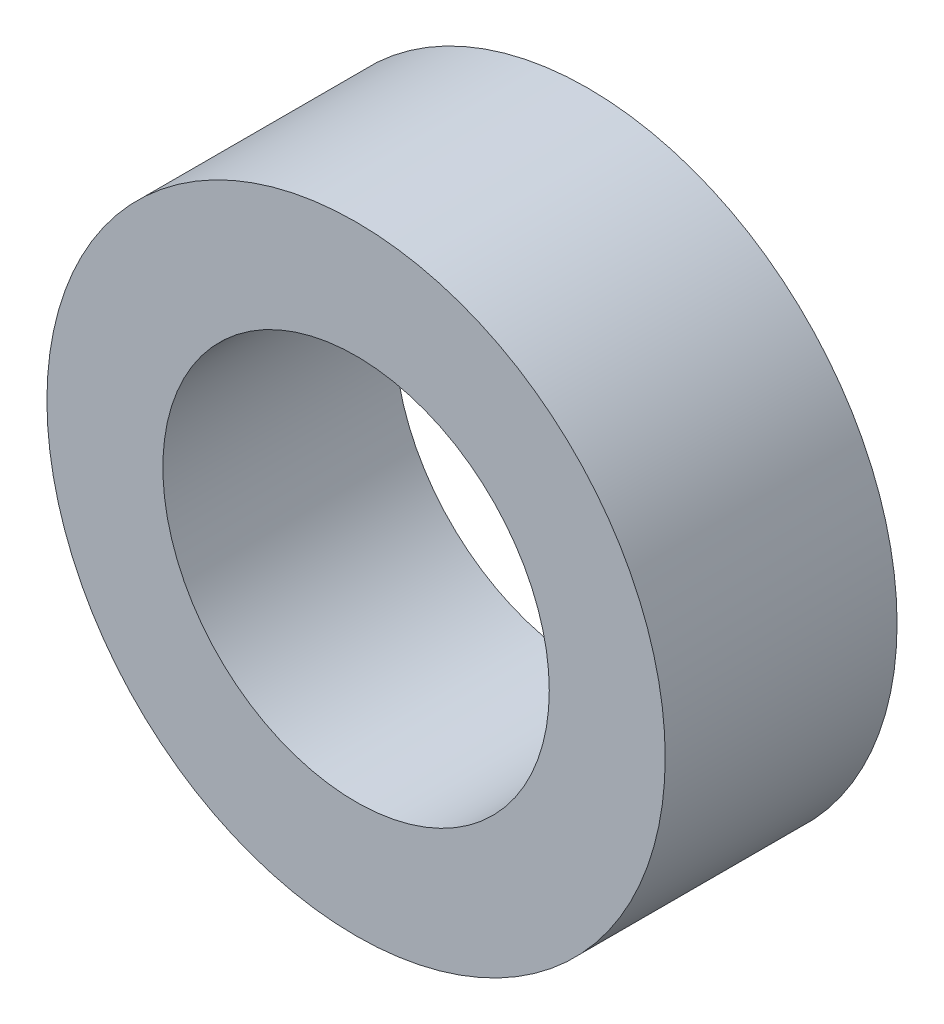
ISO-10303-21;
HEADER;
FILE_DESCRIPTION(('STEP AP214'),'2;1');
FILE_NAME('part.step','',(''),(''),'','','');
FILE_SCHEMA(('AUTOMOTIVE_DESIGN { 1 0 10303 214 1 1 1 1 }'));
ENDSEC;
DATA;
#1=APPLICATION_CONTEXT('core data for automotive mechanical design processes');
#2=APPLICATION_PROTOCOL_DEFINITION('international standard','automotive_design',2000,#1);
#3=PRODUCT_CONTEXT('',#1,'mechanical');
#4=PRODUCT('Part','Part','',(#3));
#5=PRODUCT_RELATED_PRODUCT_CATEGORY('part','',(#4));
#6=PRODUCT_DEFINITION_FORMATION('','',#4);
#7=PRODUCT_DEFINITION_CONTEXT('part definition',#1,'design');
#8=PRODUCT_DEFINITION('design','',#6,#7);
#9=PRODUCT_DEFINITION_SHAPE('','',#8);
#10=(LENGTH_UNIT() NAMED_UNIT(*) SI_UNIT(.MILLI.,.METRE.));
#11=(NAMED_UNIT(*) PLANE_ANGLE_UNIT() SI_UNIT($,.RADIAN.));
#12=(NAMED_UNIT(*) SI_UNIT($,.STERADIAN.) SOLID_ANGLE_UNIT());
#13=UNCERTAINTY_MEASURE_WITH_UNIT(LENGTH_MEASURE(1.E-05),#10,'distance_accuracy_value','');
#14=(GEOMETRIC_REPRESENTATION_CONTEXT(3) GLOBAL_UNCERTAINTY_ASSIGNED_CONTEXT((#13)) GLOBAL_UNIT_ASSIGNED_CONTEXT((#10,
#11,#12)) REPRESENTATION_CONTEXT('',''));
#15=CARTESIAN_POINT('',(0.,0.,0.));
#16=DIRECTION('',(0.,0.,1.));
#17=DIRECTION('',(1.,0.,0.));
#18=AXIS2_PLACEMENT_3D('',#15,#16,#17);
#19=CARTESIAN_POINT('',(0.,0.,3.));
#20=DIRECTION('',(0.,0.,1.));
#21=DIRECTION('',(1.,0.,0.));
#22=AXIS2_PLACEMENT_3D('',#19,#20,#21);
#23=PLANE('',#22);
#24=CARTESIAN_POINT('',(0.,0.,3.));
#25=DIRECTION('',(0.,0.,1.));
#26=DIRECTION('',(1.,0.,0.));
#27=AXIS2_PLACEMENT_3D('',#24,#25,#26);
#28=CIRCLE('',#27,4.);
#29=CARTESIAN_POINT('',(4.,0.,3.));
#30=VERTEX_POINT('',#29);
#31=EDGE_CURVE('E10',#30,#30,#28,.T.);
#32=ORIENTED_EDGE('',*,*,#31,.T.);
#33=EDGE_LOOP('',(#32));
#34=FACE_BOUND('',#33,.T.);
#35=CARTESIAN_POINT('',(0.,0.,3.));
#36=DIRECTION('',(0.,0.,1.));
#37=DIRECTION('',(1.,0.,0.));
#38=AXIS2_PLACEMENT_3D('',#35,#36,#37);
#39=CIRCLE('',#38,2.5);
#40=CARTESIAN_POINT('',(2.5,0.,3.));
#41=VERTEX_POINT('',#40);
#42=EDGE_CURVE('E44',#41,#41,#39,.T.);
#43=ORIENTED_EDGE('',*,*,#42,.F.);
#44=EDGE_LOOP('',(#43));
#45=FACE_BOUND('',#44,.T.);
#46=ADVANCED_FACE('F33',(#34,#45),#23,.T.);
#47=CARTESIAN_POINT('',(0.,0.,0.));
#48=DIRECTION('',(0.,0.,1.));
#49=DIRECTION('',(1.,0.,0.));
#50=AXIS2_PLACEMENT_3D('',#47,#48,#49);
#51=PLANE('',#50);
#52=CARTESIAN_POINT('',(0.,0.,0.));
#53=DIRECTION('',(0.,0.,1.));
#54=DIRECTION('',(1.,0.,0.));
#55=AXIS2_PLACEMENT_3D('',#52,#53,#54);
#56=CIRCLE('',#55,4.);
#57=CARTESIAN_POINT('',(4.,0.,0.));
#58=VERTEX_POINT('',#57);
#59=EDGE_CURVE('E37',#58,#58,#56,.T.);
#60=ORIENTED_EDGE('',*,*,#59,.F.);
#61=EDGE_LOOP('',(#60));
#62=FACE_BOUND('',#61,.T.);
#63=CARTESIAN_POINT('',(0.,0.,0.));
#64=DIRECTION('',(0.,0.,1.));
#65=DIRECTION('',(1.,0.,0.));
#66=AXIS2_PLACEMENT_3D('',#63,#64,#65);
#67=CIRCLE('',#66,2.5);
#68=CARTESIAN_POINT('',(2.5,0.,0.));
#69=VERTEX_POINT('',#68);
#70=EDGE_CURVE('E46',#69,#69,#67,.T.);
#71=ORIENTED_EDGE('',*,*,#70,.T.);
#72=EDGE_LOOP('',(#71));
#73=FACE_BOUND('',#72,.T.);
#74=ADVANCED_FACE('F56',(#62,#73),#51,.F.);
#75=CARTESIAN_POINT('',(0.,0.,3.));
#76=DIRECTION('',(0.,0.,-1.));
#77=DIRECTION('',(-1.,0.,0.));
#78=AXIS2_PLACEMENT_3D('',#75,#76,#77);
#79=CYLINDRICAL_SURFACE('',#78,4.);
#80=ORIENTED_EDGE('',*,*,#31,.F.);
#81=EDGE_LOOP('',(#80));
#82=FACE_BOUND('',#81,.T.);
#83=ORIENTED_EDGE('',*,*,#59,.T.);
#84=EDGE_LOOP('',(#83));
#85=FACE_BOUND('',#84,.T.);
#86=ADVANCED_FACE('F35',(#82,#85),#79,.T.);
#87=CARTESIAN_POINT('',(0.,0.,3.));
#88=DIRECTION('',(0.,0.,-1.));
#89=DIRECTION('',(-1.,0.,0.));
#90=AXIS2_PLACEMENT_3D('',#87,#88,#89);
#91=CYLINDRICAL_SURFACE('',#90,2.5);
#92=ORIENTED_EDGE('',*,*,#42,.T.);
#93=EDGE_LOOP('',(#92));
#94=FACE_BOUND('',#93,.T.);
#95=ORIENTED_EDGE('',*,*,#70,.F.);
#96=EDGE_LOOP('',(#95));
#97=FACE_BOUND('',#96,.T.);
#98=ADVANCED_FACE('F52',(#94,#97),#91,.F.);
#99=CLOSED_SHELL('',(#46,#74,#86,#98));
#100=MANIFOLD_SOLID_BREP('B2',#99);
#101=ADVANCED_BREP_SHAPE_REPRESENTATION('',(#18,#100),#14);
#102=SHAPE_DEFINITION_REPRESENTATION(#9,#101);
ENDSEC;
END-ISO-10303-21;
